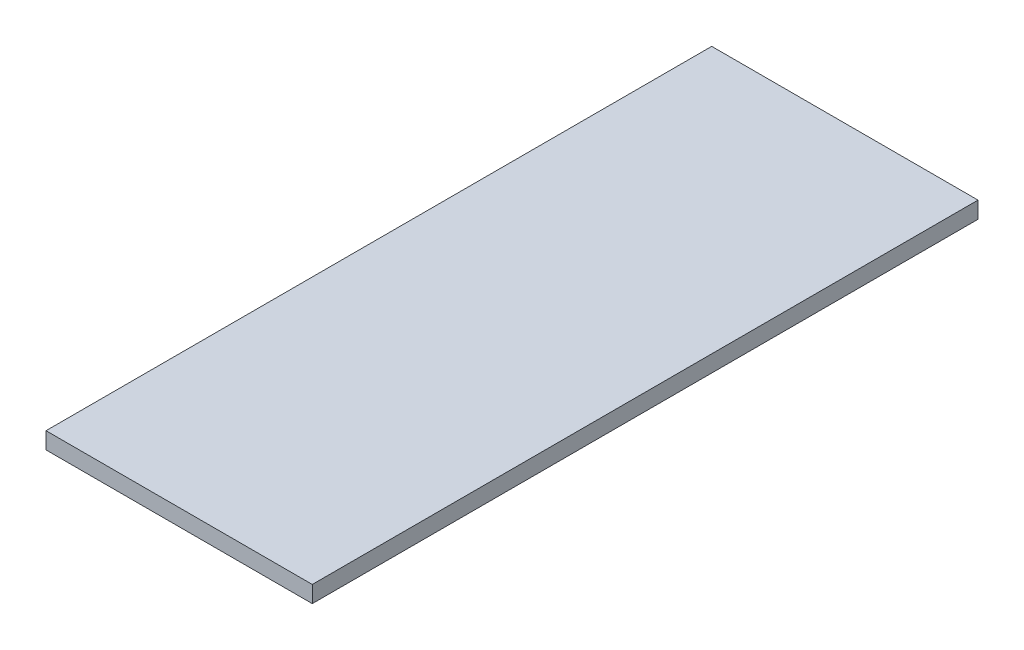
ISO-10303-21;
HEADER;
FILE_DESCRIPTION(('STEP AP214'),'2;1');
FILE_NAME('part.step','',(''),(''),'','','');
FILE_SCHEMA(('AUTOMOTIVE_DESIGN { 1 0 10303 214 1 1 1 1 }'));
ENDSEC;
DATA;
#1=APPLICATION_CONTEXT('core data for automotive mechanical design processes');
#2=APPLICATION_PROTOCOL_DEFINITION('international standard','automotive_design',2000,#1);
#3=PRODUCT_CONTEXT('',#1,'mechanical');
#4=PRODUCT('Part','Part','',(#3));
#5=PRODUCT_RELATED_PRODUCT_CATEGORY('part','',(#4));
#6=PRODUCT_DEFINITION_FORMATION('','',#4);
#7=PRODUCT_DEFINITION_CONTEXT('part definition',#1,'design');
#8=PRODUCT_DEFINITION('design','',#6,#7);
#9=PRODUCT_DEFINITION_SHAPE('','',#8);
#10=(LENGTH_UNIT() NAMED_UNIT(*) SI_UNIT(.MILLI.,.METRE.));
#11=(NAMED_UNIT(*) PLANE_ANGLE_UNIT() SI_UNIT($,.RADIAN.));
#12=(NAMED_UNIT(*) SI_UNIT($,.STERADIAN.) SOLID_ANGLE_UNIT());
#13=UNCERTAINTY_MEASURE_WITH_UNIT(LENGTH_MEASURE(1.E-05),#10,'distance_accuracy_value','');
#14=(GEOMETRIC_REPRESENTATION_CONTEXT(3) GLOBAL_UNCERTAINTY_ASSIGNED_CONTEXT((#13)) GLOBAL_UNIT_ASSIGNED_CONTEXT((#10,
#11,#12)) REPRESENTATION_CONTEXT('',''));
#15=CARTESIAN_POINT('',(0.,0.,0.));
#16=DIRECTION('',(0.,0.,1.));
#17=DIRECTION('',(1.,0.,0.));
#18=AXIS2_PLACEMENT_3D('',#15,#16,#17);
#19=CARTESIAN_POINT('',(0.,6.35,0.));
#20=DIRECTION('',(-1.,0.,0.));
#21=DIRECTION('',(0.,0.,1.));
#22=AXIS2_PLACEMENT_3D('',#19,#20,#21);
#23=PLANE('',#22);
#24=DIRECTION('',(0.,0.,-1.));
#25=VECTOR('',#24,1.);
#26=CARTESIAN_POINT('',(0.,0.,0.));
#27=LINE('',#26,#25);
#28=CARTESIAN_POINT('',(0.,0.,0.));
#29=VERTEX_POINT('',#28);
#30=CARTESIAN_POINT('',(0.,0.,-254.));
#31=VERTEX_POINT('',#30);
#32=EDGE_CURVE('E107',#29,#31,#27,.T.);
#33=ORIENTED_EDGE('',*,*,#32,.T.);
#34=DIRECTION('',(0.,-1.,0.));
#35=VECTOR('',#34,1.);
#36=CARTESIAN_POINT('',(0.,6.35,-254.));
#37=LINE('',#36,#35);
#38=CARTESIAN_POINT('',(0.,6.35,-254.));
#39=VERTEX_POINT('',#38);
#40=EDGE_CURVE('E11',#39,#31,#37,.T.);
#41=ORIENTED_EDGE('',*,*,#40,.F.);
#42=DIRECTION('',(0.,0.,-1.));
#43=VECTOR('',#42,1.);
#44=CARTESIAN_POINT('',(0.,6.35,0.));
#45=LINE('',#44,#43);
#46=CARTESIAN_POINT('',(0.,6.35,0.));
#47=VERTEX_POINT('',#46);
#48=EDGE_CURVE('E91',#47,#39,#45,.T.);
#49=ORIENTED_EDGE('',*,*,#48,.F.);
#50=DIRECTION('',(0.,-1.,0.));
#51=VECTOR('',#50,1.);
#52=CARTESIAN_POINT('',(0.,6.35,0.));
#53=LINE('',#52,#51);
#54=EDGE_CURVE('E103',#47,#29,#53,.T.);
#55=ORIENTED_EDGE('',*,*,#54,.T.);
#56=EDGE_LOOP('',(#33,#41,#49,#55));
#57=FACE_BOUND('',#56,.T.);
#58=ADVANCED_FACE('F39',(#57),#23,.F.);
#59=CARTESIAN_POINT('',(0.,6.35,-254.));
#60=DIRECTION('',(0.,0.,1.));
#61=DIRECTION('',(1.,0.,0.));
#62=AXIS2_PLACEMENT_3D('',#59,#60,#61);
#63=PLANE('',#62);
#64=DIRECTION('',(-1.,0.,0.));
#65=VECTOR('',#64,1.);
#66=CARTESIAN_POINT('',(0.,0.,-254.));
#67=LINE('',#66,#65);
#68=CARTESIAN_POINT('',(-101.6,0.,-254.));
#69=VERTEX_POINT('',#68);
#70=EDGE_CURVE('E96',#31,#69,#67,.T.);
#71=ORIENTED_EDGE('',*,*,#70,.T.);
#72=DIRECTION('',(0.,-1.,0.));
#73=VECTOR('',#72,1.);
#74=CARTESIAN_POINT('',(-101.6,6.35,-254.));
#75=LINE('',#74,#73);
#76=CARTESIAN_POINT('',(-101.6,6.35,-254.));
#77=VERTEX_POINT('',#76);
#78=EDGE_CURVE('E48',#77,#69,#75,.T.);
#79=ORIENTED_EDGE('',*,*,#78,.F.);
#80=DIRECTION('',(-1.,0.,0.));
#81=VECTOR('',#80,1.);
#82=CARTESIAN_POINT('',(0.,6.35,-254.));
#83=LINE('',#82,#81);
#84=EDGE_CURVE('E86',#39,#77,#83,.T.);
#85=ORIENTED_EDGE('',*,*,#84,.F.);
#86=ORIENTED_EDGE('',*,*,#40,.T.);
#87=EDGE_LOOP('',(#71,#79,#85,#86));
#88=FACE_BOUND('',#87,.T.);
#89=ADVANCED_FACE('F95',(#88),#63,.F.);
#90=CARTESIAN_POINT('',(-101.6,6.35,0.));
#91=DIRECTION('',(1.,0.,0.));
#92=DIRECTION('',(0.,0.,-1.));
#93=AXIS2_PLACEMENT_3D('',#90,#91,#92);
#94=PLANE('',#93);
#95=DIRECTION('',(0.,0.,1.));
#96=VECTOR('',#95,1.);
#97=CARTESIAN_POINT('',(-101.6,0.,0.));
#98=LINE('',#97,#96);
#99=CARTESIAN_POINT('',(-101.6,0.,0.));
#100=VERTEX_POINT('',#99);
#101=EDGE_CURVE('E73',#69,#100,#98,.T.);
#102=ORIENTED_EDGE('',*,*,#101,.T.);
#103=DIRECTION('',(0.,-1.,0.));
#104=VECTOR('',#103,1.);
#105=CARTESIAN_POINT('',(-101.6,6.35,0.));
#106=LINE('',#105,#104);
#107=CARTESIAN_POINT('',(-101.6,6.35,0.));
#108=VERTEX_POINT('',#107);
#109=EDGE_CURVE('E98',#108,#100,#106,.T.);
#110=ORIENTED_EDGE('',*,*,#109,.F.);
#111=DIRECTION('',(0.,0.,1.));
#112=VECTOR('',#111,1.);
#113=CARTESIAN_POINT('',(-101.6,6.35,0.));
#114=LINE('',#113,#112);
#115=EDGE_CURVE('E89',#77,#108,#114,.T.);
#116=ORIENTED_EDGE('',*,*,#115,.F.);
#117=ORIENTED_EDGE('',*,*,#78,.T.);
#118=EDGE_LOOP('',(#102,#110,#116,#117));
#119=FACE_BOUND('',#118,.T.);
#120=ADVANCED_FACE('F99',(#119),#94,.F.);
#121=CARTESIAN_POINT('',(0.,6.35,0.));
#122=DIRECTION('',(0.,0.,-1.));
#123=DIRECTION('',(-1.,0.,0.));
#124=AXIS2_PLACEMENT_3D('',#121,#122,#123);
#125=PLANE('',#124);
#126=DIRECTION('',(1.,0.,0.));
#127=VECTOR('',#126,1.);
#128=CARTESIAN_POINT('',(0.,0.,0.));
#129=LINE('',#128,#127);
#130=EDGE_CURVE('E79',#100,#29,#129,.T.);
#131=ORIENTED_EDGE('',*,*,#130,.T.);
#132=ORIENTED_EDGE('',*,*,#54,.F.);
#133=DIRECTION('',(1.,0.,0.));
#134=VECTOR('',#133,1.);
#135=CARTESIAN_POINT('',(0.,6.35,0.));
#136=LINE('',#135,#134);
#137=EDGE_CURVE('E56',#108,#47,#136,.T.);
#138=ORIENTED_EDGE('',*,*,#137,.F.);
#139=ORIENTED_EDGE('',*,*,#109,.T.);
#140=EDGE_LOOP('',(#131,#132,#138,#139));
#141=FACE_BOUND('',#140,.T.);
#142=ADVANCED_FACE('F120',(#141),#125,.F.);
#143=CARTESIAN_POINT('',(0.,6.35,0.));
#144=DIRECTION('',(0.,1.,0.));
#145=DIRECTION('',(0.,0.,1.));
#146=AXIS2_PLACEMENT_3D('',#143,#144,#145);
#147=PLANE('',#146);
#148=ORIENTED_EDGE('',*,*,#48,.T.);
#149=ORIENTED_EDGE('',*,*,#84,.T.);
#150=ORIENTED_EDGE('',*,*,#115,.T.);
#151=ORIENTED_EDGE('',*,*,#137,.T.);
#152=EDGE_LOOP('',(#148,#149,#150,#151));
#153=FACE_BOUND('',#152,.T.);
#154=ADVANCED_FACE('F87',(#153),#147,.T.);
#155=CARTESIAN_POINT('',(0.,0.,0.));
#156=DIRECTION('',(0.,1.,0.));
#157=DIRECTION('',(0.,0.,1.));
#158=AXIS2_PLACEMENT_3D('',#155,#156,#157);
#159=PLANE('',#158);
#160=ORIENTED_EDGE('',*,*,#32,.F.);
#161=ORIENTED_EDGE('',*,*,#130,.F.);
#162=ORIENTED_EDGE('',*,*,#101,.F.);
#163=ORIENTED_EDGE('',*,*,#70,.F.);
#164=EDGE_LOOP('',(#160,#161,#162,#163));
#165=FACE_BOUND('',#164,.T.);
#166=ADVANCED_FACE('F123',(#165),#159,.F.);
#167=CLOSED_SHELL('',(#58,#89,#120,#142,#154,#166));
#168=MANIFOLD_SOLID_BREP('B2',#167);
#169=ADVANCED_BREP_SHAPE_REPRESENTATION('',(#18,#168),#14);
#170=SHAPE_DEFINITION_REPRESENTATION(#9,#169);
ENDSEC;
END-ISO-10303-21;
